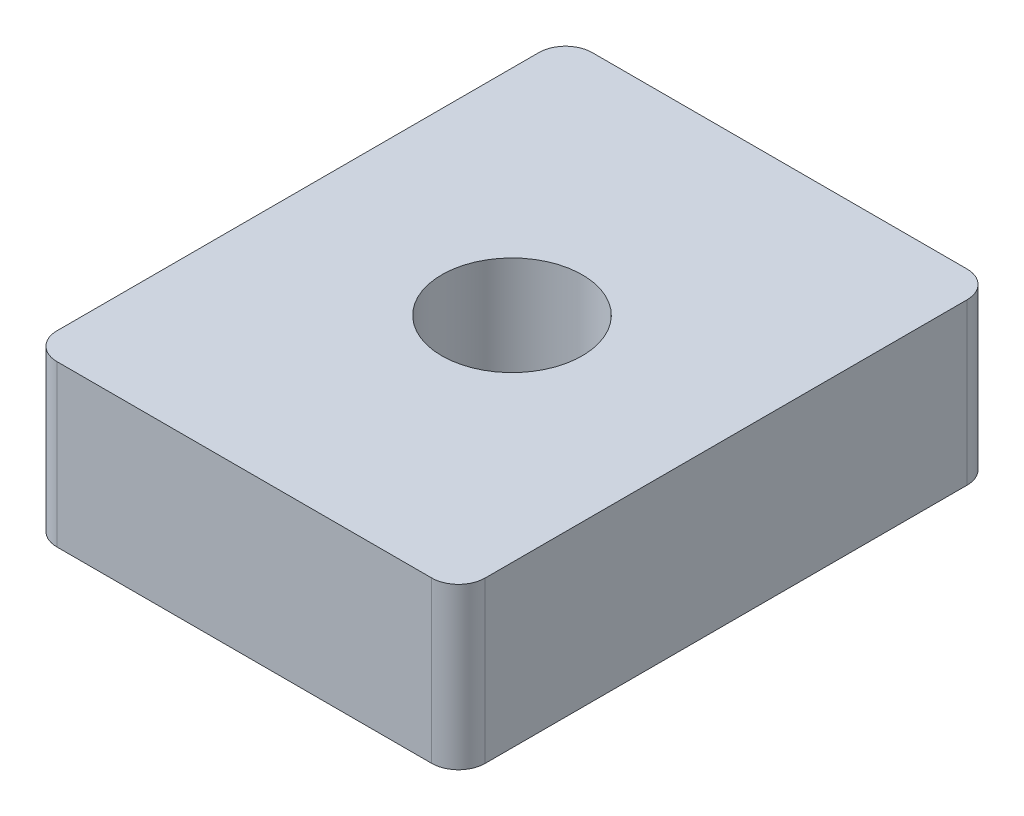
ISO-10303-21;
HEADER;
FILE_DESCRIPTION(('STEP AP214'),'2;1');
FILE_NAME('part.step','',(''),(''),'','','');
FILE_SCHEMA(('AUTOMOTIVE_DESIGN { 1 0 10303 214 1 1 1 1 }'));
ENDSEC;
DATA;
#1=APPLICATION_CONTEXT('core data for automotive mechanical design processes');
#2=APPLICATION_PROTOCOL_DEFINITION('international standard','automotive_design',2000,#1);
#3=PRODUCT_CONTEXT('',#1,'mechanical');
#4=PRODUCT('Part','Part','',(#3));
#5=PRODUCT_RELATED_PRODUCT_CATEGORY('part','',(#4));
#6=PRODUCT_DEFINITION_FORMATION('','',#4);
#7=PRODUCT_DEFINITION_CONTEXT('part definition',#1,'design');
#8=PRODUCT_DEFINITION('design','',#6,#7);
#9=PRODUCT_DEFINITION_SHAPE('','',#8);
#10=(LENGTH_UNIT() NAMED_UNIT(*) SI_UNIT(.MILLI.,.METRE.));
#11=(NAMED_UNIT(*) PLANE_ANGLE_UNIT() SI_UNIT($,.RADIAN.));
#12=(NAMED_UNIT(*) SI_UNIT($,.STERADIAN.) SOLID_ANGLE_UNIT());
#13=UNCERTAINTY_MEASURE_WITH_UNIT(LENGTH_MEASURE(1.E-05),#10,'distance_accuracy_value','');
#14=(GEOMETRIC_REPRESENTATION_CONTEXT(3) GLOBAL_UNCERTAINTY_ASSIGNED_CONTEXT((#13)) GLOBAL_UNIT_ASSIGNED_CONTEXT((#10,
#11,#12)) REPRESENTATION_CONTEXT('',''));
#15=CARTESIAN_POINT('',(0.,0.,0.));
#16=DIRECTION('',(0.,0.,1.));
#17=DIRECTION('',(1.,0.,0.));
#18=AXIS2_PLACEMENT_3D('',#15,#16,#17);
#19=CARTESIAN_POINT('',(7.,6.,-9.));
#20=DIRECTION('',(0.,-1.,0.));
#21=DIRECTION('',(0.,0.,-1.));
#22=AXIS2_PLACEMENT_3D('',#19,#20,#21);
#23=PLANE('',#22);
#24=CARTESIAN_POINT('',(7.,6.,-9.));
#25=DIRECTION('',(0.,1.,0.));
#26=DIRECTION('',(0.,0.,-1.));
#27=AXIS2_PLACEMENT_3D('',#24,#25,#26);
#28=CIRCLE('',#27,1.);
#29=CARTESIAN_POINT('',(8.,6.,-9.));
#30=VERTEX_POINT('',#29);
#31=CARTESIAN_POINT('',(7.,6.,-10.));
#32=VERTEX_POINT('',#31);
#33=EDGE_CURVE('E179',#30,#32,#28,.T.);
#34=ORIENTED_EDGE('',*,*,#33,.T.);
#35=DIRECTION('',(-1.,0.,0.));
#36=VECTOR('',#35,1.);
#37=CARTESIAN_POINT('',(-7.,6.,-10.));
#38=LINE('',#37,#36);
#39=CARTESIAN_POINT('',(-7.,6.,-10.));
#40=VERTEX_POINT('',#39);
#41=EDGE_CURVE('E109',#32,#40,#38,.T.);
#42=ORIENTED_EDGE('',*,*,#41,.T.);
#43=CARTESIAN_POINT('',(-7.,6.,-9.));
#44=DIRECTION('',(0.,1.,0.));
#45=DIRECTION('',(0.,0.,1.));
#46=AXIS2_PLACEMENT_3D('',#43,#44,#45);
#47=CIRCLE('',#46,1.);
#48=CARTESIAN_POINT('',(-8.,6.,-9.));
#49=VERTEX_POINT('',#48);
#50=EDGE_CURVE('E201',#40,#49,#47,.T.);
#51=ORIENTED_EDGE('',*,*,#50,.T.);
#52=DIRECTION('',(0.,0.,1.));
#53=VECTOR('',#52,1.);
#54=CARTESIAN_POINT('',(-8.,6.,-9.));
#55=LINE('',#54,#53);
#56=CARTESIAN_POINT('',(-8.,6.,9.));
#57=VERTEX_POINT('',#56);
#58=EDGE_CURVE('E215',#49,#57,#55,.T.);
#59=ORIENTED_EDGE('',*,*,#58,.T.);
#60=CARTESIAN_POINT('',(-7.,6.,9.));
#61=DIRECTION('',(0.,1.,0.));
#62=DIRECTION('',(0.,0.,1.));
#63=AXIS2_PLACEMENT_3D('',#60,#61,#62);
#64=CIRCLE('',#63,1.);
#65=CARTESIAN_POINT('',(-7.,6.,10.));
#66=VERTEX_POINT('',#65);
#67=EDGE_CURVE('E133',#57,#66,#64,.T.);
#68=ORIENTED_EDGE('',*,*,#67,.T.);
#69=DIRECTION('',(1.,0.,0.));
#70=VECTOR('',#69,1.);
#71=CARTESIAN_POINT('',(-7.,6.,10.));
#72=LINE('',#71,#70);
#73=CARTESIAN_POINT('',(7.,6.,10.));
#74=VERTEX_POINT('',#73);
#75=EDGE_CURVE('E127',#66,#74,#72,.T.);
#76=ORIENTED_EDGE('',*,*,#75,.T.);
#77=CARTESIAN_POINT('',(7.,6.,9.));
#78=DIRECTION('',(0.,1.,0.));
#79=DIRECTION('',(0.,0.,-1.));
#80=AXIS2_PLACEMENT_3D('',#77,#78,#79);
#81=CIRCLE('',#80,1.);
#82=CARTESIAN_POINT('',(8.,6.,9.));
#83=VERTEX_POINT('',#82);
#84=EDGE_CURVE('E131',#74,#83,#81,.T.);
#85=ORIENTED_EDGE('',*,*,#84,.T.);
#86=DIRECTION('',(0.,0.,-1.));
#87=VECTOR('',#86,1.);
#88=CARTESIAN_POINT('',(8.,6.,-9.));
#89=LINE('',#88,#87);
#90=EDGE_CURVE('E57',#83,#30,#89,.T.);
#91=ORIENTED_EDGE('',*,*,#90,.T.);
#92=EDGE_LOOP('',(#34,#42,#51,#59,#68,#76,#85,#91));
#93=FACE_BOUND('',#92,.T.);
#94=CARTESIAN_POINT('',(0.,6.,0.));
#95=DIRECTION('',(0.,1.,0.));
#96=DIRECTION('',(0.,0.,1.));
#97=AXIS2_PLACEMENT_3D('',#94,#95,#96);
#98=CIRCLE('',#97,2.625);
#99=CARTESIAN_POINT('',(0.,6.,2.625));
#100=VERTEX_POINT('',#99);
#101=EDGE_CURVE('E161',#100,#100,#98,.T.);
#102=ORIENTED_EDGE('',*,*,#101,.F.);
#103=EDGE_LOOP('',(#102));
#104=FACE_BOUND('',#103,.T.);
#105=ADVANCED_FACE('F39',(#93,#104),#23,.F.);
#106=CARTESIAN_POINT('',(7.,0.,-9.));
#107=DIRECTION('',(0.,-1.,0.));
#108=DIRECTION('',(0.,0.,-1.));
#109=AXIS2_PLACEMENT_3D('',#106,#107,#108);
#110=PLANE('',#109);
#111=CARTESIAN_POINT('',(7.,0.,-9.));
#112=DIRECTION('',(0.,1.,0.));
#113=DIRECTION('',(0.,0.,-1.));
#114=AXIS2_PLACEMENT_3D('',#111,#112,#113);
#115=CIRCLE('',#114,1.);
#116=CARTESIAN_POINT('',(8.,0.,-9.));
#117=VERTEX_POINT('',#116);
#118=CARTESIAN_POINT('',(7.,0.,-10.));
#119=VERTEX_POINT('',#118);
#120=EDGE_CURVE('E156',#117,#119,#115,.T.);
#121=ORIENTED_EDGE('',*,*,#120,.F.);
#122=DIRECTION('',(0.,0.,-1.));
#123=VECTOR('',#122,1.);
#124=CARTESIAN_POINT('',(8.,0.,-9.));
#125=LINE('',#124,#123);
#126=CARTESIAN_POINT('',(8.,0.,9.));
#127=VERTEX_POINT('',#126);
#128=EDGE_CURVE('E101',#127,#117,#125,.T.);
#129=ORIENTED_EDGE('',*,*,#128,.F.);
#130=CARTESIAN_POINT('',(7.,0.,9.));
#131=DIRECTION('',(0.,1.,0.));
#132=DIRECTION('',(0.,0.,-1.));
#133=AXIS2_PLACEMENT_3D('',#130,#131,#132);
#134=CIRCLE('',#133,1.);
#135=CARTESIAN_POINT('',(7.,0.,10.));
#136=VERTEX_POINT('',#135);
#137=EDGE_CURVE('E95',#136,#127,#134,.T.);
#138=ORIENTED_EDGE('',*,*,#137,.F.);
#139=DIRECTION('',(1.,0.,0.));
#140=VECTOR('',#139,1.);
#141=CARTESIAN_POINT('',(-7.,0.,10.));
#142=LINE('',#141,#140);
#143=CARTESIAN_POINT('',(-7.,0.,10.));
#144=VERTEX_POINT('',#143);
#145=EDGE_CURVE('E142',#144,#136,#142,.T.);
#146=ORIENTED_EDGE('',*,*,#145,.F.);
#147=CARTESIAN_POINT('',(-7.,0.,9.));
#148=DIRECTION('',(0.,1.,0.));
#149=DIRECTION('',(0.,0.,1.));
#150=AXIS2_PLACEMENT_3D('',#147,#148,#149);
#151=CIRCLE('',#150,1.);
#152=CARTESIAN_POINT('',(-8.,0.,9.));
#153=VERTEX_POINT('',#152);
#154=EDGE_CURVE('E170',#153,#144,#151,.T.);
#155=ORIENTED_EDGE('',*,*,#154,.F.);
#156=DIRECTION('',(0.,0.,1.));
#157=VECTOR('',#156,1.);
#158=CARTESIAN_POINT('',(-8.,0.,-9.));
#159=LINE('',#158,#157);
#160=CARTESIAN_POINT('',(-8.,0.,-9.));
#161=VERTEX_POINT('',#160);
#162=EDGE_CURVE('E167',#161,#153,#159,.T.);
#163=ORIENTED_EDGE('',*,*,#162,.F.);
#164=CARTESIAN_POINT('',(-7.,0.,-9.));
#165=DIRECTION('',(0.,1.,0.));
#166=DIRECTION('',(0.,0.,1.));
#167=AXIS2_PLACEMENT_3D('',#164,#165,#166);
#168=CIRCLE('',#167,1.);
#169=CARTESIAN_POINT('',(-7.,0.,-10.));
#170=VERTEX_POINT('',#169);
#171=EDGE_CURVE('E164',#170,#161,#168,.T.);
#172=ORIENTED_EDGE('',*,*,#171,.F.);
#173=DIRECTION('',(-1.,0.,0.));
#174=VECTOR('',#173,1.);
#175=CARTESIAN_POINT('',(-7.,0.,-10.));
#176=LINE('',#175,#174);
#177=EDGE_CURVE('E160',#119,#170,#176,.T.);
#178=ORIENTED_EDGE('',*,*,#177,.F.);
#179=EDGE_LOOP('',(#121,#129,#138,#146,#155,#163,#172,#178));
#180=FACE_BOUND('',#179,.T.);
#181=CARTESIAN_POINT('',(0.,0.,0.));
#182=DIRECTION('',(0.,1.,0.));
#183=DIRECTION('',(0.,0.,1.));
#184=AXIS2_PLACEMENT_3D('',#181,#182,#183);
#185=CIRCLE('',#184,2.625);
#186=CARTESIAN_POINT('',(0.,0.,2.625));
#187=VERTEX_POINT('',#186);
#188=EDGE_CURVE('E222',#187,#187,#185,.T.);
#189=ORIENTED_EDGE('',*,*,#188,.T.);
#190=EDGE_LOOP('',(#189));
#191=FACE_BOUND('',#190,.T.);
#192=ADVANCED_FACE('F205',(#180,#191),#110,.T.);
#193=CARTESIAN_POINT('',(7.,6.,-9.));
#194=DIRECTION('',(0.,-1.,0.));
#195=DIRECTION('',(0.,0.,-1.));
#196=AXIS2_PLACEMENT_3D('',#193,#194,#195);
#197=CYLINDRICAL_SURFACE('',#196,1.);
#198=ORIENTED_EDGE('',*,*,#120,.T.);
#199=DIRECTION('',(0.,-1.,0.));
#200=VECTOR('',#199,1.);
#201=CARTESIAN_POINT('',(7.,6.,-10.));
#202=LINE('',#201,#200);
#203=EDGE_CURVE('E11',#32,#119,#202,.T.);
#204=ORIENTED_EDGE('',*,*,#203,.F.);
#205=ORIENTED_EDGE('',*,*,#33,.F.);
#206=DIRECTION('',(0.,-1.,0.));
#207=VECTOR('',#206,1.);
#208=CARTESIAN_POINT('',(8.,6.,-9.));
#209=LINE('',#208,#207);
#210=EDGE_CURVE('E152',#30,#117,#209,.T.);
#211=ORIENTED_EDGE('',*,*,#210,.T.);
#212=EDGE_LOOP('',(#198,#204,#205,#211));
#213=FACE_BOUND('',#212,.T.);
#214=ADVANCED_FACE('F41',(#213),#197,.T.);
#215=CARTESIAN_POINT('',(-7.,6.,-10.));
#216=DIRECTION('',(0.,0.,1.));
#217=DIRECTION('',(1.,0.,0.));
#218=AXIS2_PLACEMENT_3D('',#215,#216,#217);
#219=PLANE('',#218);
#220=ORIENTED_EDGE('',*,*,#177,.T.);
#221=DIRECTION('',(0.,-1.,0.));
#222=VECTOR('',#221,1.);
#223=CARTESIAN_POINT('',(-7.,6.,-10.));
#224=LINE('',#223,#222);
#225=EDGE_CURVE('E49',#40,#170,#224,.T.);
#226=ORIENTED_EDGE('',*,*,#225,.F.);
#227=ORIENTED_EDGE('',*,*,#41,.F.);
#228=ORIENTED_EDGE('',*,*,#203,.T.);
#229=EDGE_LOOP('',(#220,#226,#227,#228));
#230=FACE_BOUND('',#229,.T.);
#231=ADVANCED_FACE('F251',(#230),#219,.F.);
#232=CARTESIAN_POINT('',(-7.,6.,-9.));
#233=DIRECTION('',(0.,-1.,0.));
#234=DIRECTION('',(0.,0.,-1.));
#235=AXIS2_PLACEMENT_3D('',#232,#233,#234);
#236=CYLINDRICAL_SURFACE('',#235,1.);
#237=ORIENTED_EDGE('',*,*,#171,.T.);
#238=DIRECTION('',(0.,-1.,0.));
#239=VECTOR('',#238,1.);
#240=CARTESIAN_POINT('',(-8.,6.,-9.));
#241=LINE('',#240,#239);
#242=EDGE_CURVE('E190',#49,#161,#241,.T.);
#243=ORIENTED_EDGE('',*,*,#242,.F.);
#244=ORIENTED_EDGE('',*,*,#50,.F.);
#245=ORIENTED_EDGE('',*,*,#225,.T.);
#246=EDGE_LOOP('',(#237,#243,#244,#245));
#247=FACE_BOUND('',#246,.T.);
#248=ADVANCED_FACE('F199',(#247),#236,.T.);
#249=CARTESIAN_POINT('',(-8.,6.,-9.));
#250=DIRECTION('',(1.,0.,0.));
#251=DIRECTION('',(0.,0.,-1.));
#252=AXIS2_PLACEMENT_3D('',#249,#250,#251);
#253=PLANE('',#252);
#254=ORIENTED_EDGE('',*,*,#162,.T.);
#255=DIRECTION('',(0.,-1.,0.));
#256=VECTOR('',#255,1.);
#257=CARTESIAN_POINT('',(-8.,6.,9.));
#258=LINE('',#257,#256);
#259=EDGE_CURVE('E186',#57,#153,#258,.T.);
#260=ORIENTED_EDGE('',*,*,#259,.F.);
#261=ORIENTED_EDGE('',*,*,#58,.F.);
#262=ORIENTED_EDGE('',*,*,#242,.T.);
#263=EDGE_LOOP('',(#254,#260,#261,#262));
#264=FACE_BOUND('',#263,.T.);
#265=ADVANCED_FACE('F210',(#264),#253,.F.);
#266=CARTESIAN_POINT('',(-7.,6.,9.));
#267=DIRECTION('',(0.,-1.,0.));
#268=DIRECTION('',(0.,0.,-1.));
#269=AXIS2_PLACEMENT_3D('',#266,#267,#268);
#270=CYLINDRICAL_SURFACE('',#269,1.);
#271=ORIENTED_EDGE('',*,*,#154,.T.);
#272=DIRECTION('',(0.,-1.,0.));
#273=VECTOR('',#272,1.);
#274=CARTESIAN_POINT('',(-7.,6.,10.));
#275=LINE('',#274,#273);
#276=EDGE_CURVE('E144',#66,#144,#275,.T.);
#277=ORIENTED_EDGE('',*,*,#276,.F.);
#278=ORIENTED_EDGE('',*,*,#67,.F.);
#279=ORIENTED_EDGE('',*,*,#259,.T.);
#280=EDGE_LOOP('',(#271,#277,#278,#279));
#281=FACE_BOUND('',#280,.T.);
#282=ADVANCED_FACE('F213',(#281),#270,.T.);
#283=CARTESIAN_POINT('',(-7.,6.,10.));
#284=DIRECTION('',(0.,0.,-1.));
#285=DIRECTION('',(-1.,0.,0.));
#286=AXIS2_PLACEMENT_3D('',#283,#284,#285);
#287=PLANE('',#286);
#288=ORIENTED_EDGE('',*,*,#145,.T.);
#289=DIRECTION('',(0.,-1.,0.));
#290=VECTOR('',#289,1.);
#291=CARTESIAN_POINT('',(7.,6.,10.));
#292=LINE('',#291,#290);
#293=EDGE_CURVE('E139',#74,#136,#292,.T.);
#294=ORIENTED_EDGE('',*,*,#293,.F.);
#295=ORIENTED_EDGE('',*,*,#75,.F.);
#296=ORIENTED_EDGE('',*,*,#276,.T.);
#297=EDGE_LOOP('',(#288,#294,#295,#296));
#298=FACE_BOUND('',#297,.T.);
#299=ADVANCED_FACE('F140',(#298),#287,.F.);
#300=CARTESIAN_POINT('',(7.,6.,9.));
#301=DIRECTION('',(0.,-1.,0.));
#302=DIRECTION('',(0.,0.,-1.));
#303=AXIS2_PLACEMENT_3D('',#300,#301,#302);
#304=CYLINDRICAL_SURFACE('',#303,1.);
#305=ORIENTED_EDGE('',*,*,#137,.T.);
#306=DIRECTION('',(0.,-1.,0.));
#307=VECTOR('',#306,1.);
#308=CARTESIAN_POINT('',(8.,6.,9.));
#309=LINE('',#308,#307);
#310=EDGE_CURVE('E145',#83,#127,#309,.T.);
#311=ORIENTED_EDGE('',*,*,#310,.F.);
#312=ORIENTED_EDGE('',*,*,#84,.F.);
#313=ORIENTED_EDGE('',*,*,#293,.T.);
#314=EDGE_LOOP('',(#305,#311,#312,#313));
#315=FACE_BOUND('',#314,.T.);
#316=ADVANCED_FACE('F147',(#315),#304,.T.);
#317=CARTESIAN_POINT('',(8.,6.,-9.));
#318=DIRECTION('',(-1.,0.,0.));
#319=DIRECTION('',(0.,0.,1.));
#320=AXIS2_PLACEMENT_3D('',#317,#318,#319);
#321=PLANE('',#320);
#322=ORIENTED_EDGE('',*,*,#128,.T.);
#323=ORIENTED_EDGE('',*,*,#210,.F.);
#324=ORIENTED_EDGE('',*,*,#90,.F.);
#325=ORIENTED_EDGE('',*,*,#310,.T.);
#326=EDGE_LOOP('',(#322,#323,#324,#325));
#327=FACE_BOUND('',#326,.T.);
#328=ADVANCED_FACE('F239',(#327),#321,.F.);
#329=CARTESIAN_POINT('',(0.,6.,0.));
#330=DIRECTION('',(0.,-1.,0.));
#331=DIRECTION('',(0.,0.,-1.));
#332=AXIS2_PLACEMENT_3D('',#329,#330,#331);
#333=CYLINDRICAL_SURFACE('',#332,2.625);
#334=ORIENTED_EDGE('',*,*,#101,.T.);
#335=EDGE_LOOP('',(#334));
#336=FACE_BOUND('',#335,.T.);
#337=ORIENTED_EDGE('',*,*,#188,.F.);
#338=EDGE_LOOP('',(#337));
#339=FACE_BOUND('',#338,.T.);
#340=ADVANCED_FACE('F229',(#336,#339),#333,.F.);
#341=CLOSED_SHELL('',(#105,#192,#214,#231,#248,#265,#282,#299,#316,#328,#340));
#342=MANIFOLD_SOLID_BREP('B2',#341);
#343=ADVANCED_BREP_SHAPE_REPRESENTATION('',(#18,#342),#14);
#344=SHAPE_DEFINITION_REPRESENTATION(#9,#343);
ENDSEC;
END-ISO-10303-21;
